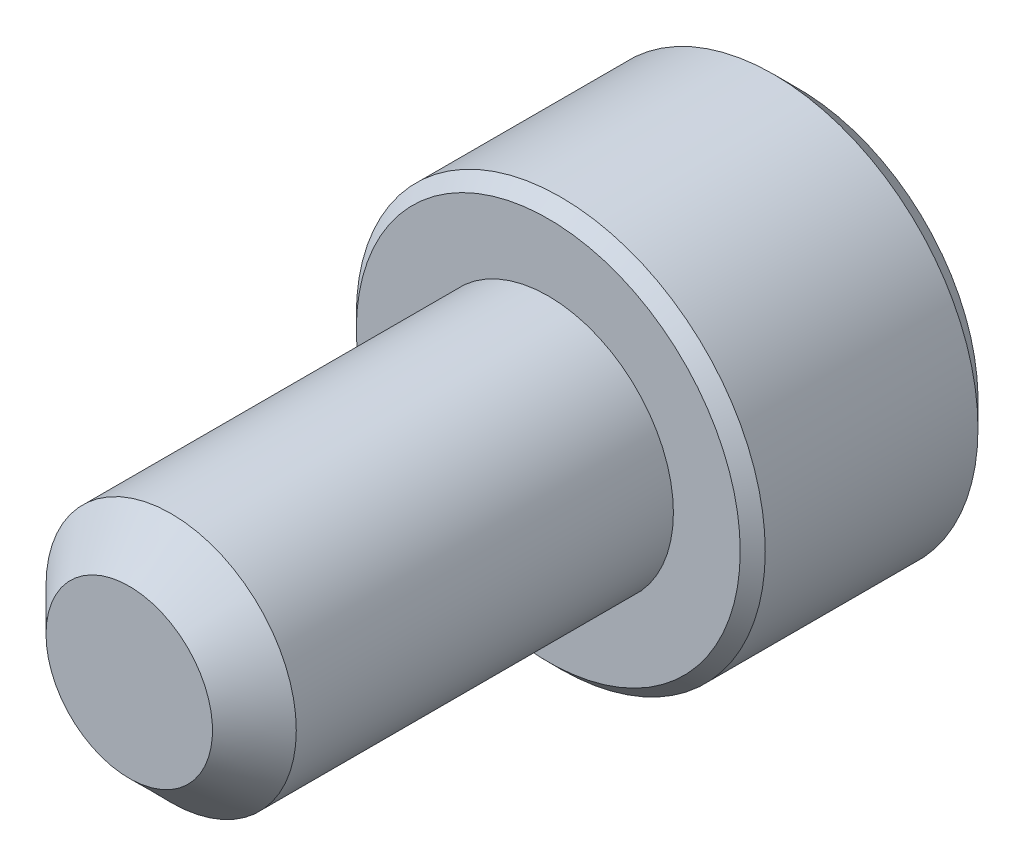
ISO-10303-21;
HEADER;
FILE_DESCRIPTION(('STEP AP214'),'2;1');
FILE_NAME('part.step','',(''),(''),'','','');
FILE_SCHEMA(('AUTOMOTIVE_DESIGN { 1 0 10303 214 1 1 1 1 }'));
ENDSEC;
DATA;
#1=APPLICATION_CONTEXT('core data for automotive mechanical design processes');
#2=APPLICATION_PROTOCOL_DEFINITION('international standard','automotive_design',2000,#1);
#3=PRODUCT_CONTEXT('',#1,'mechanical');
#4=PRODUCT('Part','Part','',(#3));
#5=PRODUCT_RELATED_PRODUCT_CATEGORY('part','',(#4));
#6=PRODUCT_DEFINITION_FORMATION('','',#4);
#7=PRODUCT_DEFINITION_CONTEXT('part definition',#1,'design');
#8=PRODUCT_DEFINITION('design','',#6,#7);
#9=PRODUCT_DEFINITION_SHAPE('','',#8);
#10=(LENGTH_UNIT() NAMED_UNIT(*) SI_UNIT(.MILLI.,.METRE.));
#11=(NAMED_UNIT(*) PLANE_ANGLE_UNIT() SI_UNIT($,.RADIAN.));
#12=(NAMED_UNIT(*) SI_UNIT($,.STERADIAN.) SOLID_ANGLE_UNIT());
#13=UNCERTAINTY_MEASURE_WITH_UNIT(LENGTH_MEASURE(1.E-05),#10,'distance_accuracy_value','');
#14=(GEOMETRIC_REPRESENTATION_CONTEXT(3) GLOBAL_UNCERTAINTY_ASSIGNED_CONTEXT((#13)) GLOBAL_UNIT_ASSIGNED_CONTEXT((#10,
#11,#12)) REPRESENTATION_CONTEXT('',''));
#15=CARTESIAN_POINT('',(0.,0.,0.));
#16=DIRECTION('',(0.,0.,1.));
#17=DIRECTION('',(1.,0.,0.));
#18=AXIS2_PLACEMENT_3D('',#15,#16,#17);
#19=CARTESIAN_POINT('',(0.,-1.3748153285078,-5.8213625));
#20=DIRECTION('',(-0.5,-0.866025403784439,0.));
#21=DIRECTION('',(0.866025403784439,-0.5,0.));
#22=AXIS2_PLACEMENT_3D('',#19,#20,#21);
#23=PLANE('',#22);
#24=CARTESIAN_POINT('',(-1.19062500001474,-0.687407664245389,-7.60729999995952));
#25=CARTESIAN_POINT('',(-1.14970263916378,-0.711034200298566,-7.58369613528999));
#26=CARTESIAN_POINT('',(-1.10809605275945,-0.735055774159164,-7.56147879632089));
#27=CARTESIAN_POINT('',(-1.02325595333944,-0.784038228397384,-7.52079979726755));
#28=CARTESIAN_POINT('',(-0.98001437643467,-0.809003764463537,-7.50236076356995));
#29=CARTESIAN_POINT('',(-0.89281986332562,-0.859345540078905,-7.47077457060107));
#30=CARTESIAN_POINT('',(-0.848889120877259,-0.884708966057167,-7.45754804212946));
#31=CARTESIAN_POINT('',(-0.76006074704934,-0.935994051598392,-7.43717007140658));
#32=CARTESIAN_POINT('',(-0.715165827353507,-0.961914145570028,-7.43000342342216));
#33=CARTESIAN_POINT('',(-0.637785345132547,-1.00658978781032,-7.42353686841741));
#34=CARTESIAN_POINT('',(-0.605399644533085,-1.02528768076932,-7.42257994963504));
#35=CARTESIAN_POINT('',(-0.540685248331174,-1.06265055483693,-7.42419472913948));
#36=CARTESIAN_POINT('',(-0.508356566900302,-1.08131552776359,-7.4267672068878));
#37=CARTESIAN_POINT('',(-0.444011322800891,-1.11846527176546,-7.43529207148953));
#38=CARTESIAN_POINT('',(-0.411995078567319,-1.13694985899215,-7.44124760127793));
#39=CARTESIAN_POINT('',(-0.348497138374104,-1.17361041185569,-7.45621782107217));
#40=CARTESIAN_POINT('',(-0.317015677884089,-1.19178624154409,-7.4652338237534));
#41=CARTESIAN_POINT('',(-0.236423425362924,-1.23831620023178,-7.4919792357716));
#42=CARTESIAN_POINT('',(-0.187819783517283,-1.26637752593496,-7.51171600111601));
#43=CARTESIAN_POINT('',(-0.092514044344822,-1.32140232010149,-7.55617313923926));
#44=CARTESIAN_POINT('',(-0.045806337004702,-1.34836902750754,-7.58087728917109));
#45=CARTESIAN_POINT('',(1.47390955299064E-11,-1.37481532851631,-7.60729999995952));
#46=B_SPLINE_CURVE_WITH_KNOTS('',3,(#24,#25,#26,#27,#28,#29,#30,#31,#32,#33,#34,#35,#36,#37,#38,
#39,#40,#41,#42,#43,#44,#45),.UNSPECIFIED.,.F.,.F.,(4,2,2,2,2,2,2,2,2,2,4),(0.,
0.158570945776655,0.318065397816435,0.475027617250887,0.631594801049637,0.743660160737506,
0.855750273863031,0.967944692049585,1.08018729276811,1.2583629104134,1.43596581388887),.UNSPECIFIED.);
#47=CARTESIAN_POINT('',(-1.19062500000866,-0.687407664257408,-7.60729999996027));
#48=VERTEX_POINT('',#47);
#49=CARTESIAN_POINT('',(-1.29196725261189E-12,-1.37481532851705,-7.60729999996027));
#50=VERTEX_POINT('',#49);
#51=EDGE_CURVE('E18',#48,#50,#46,.T.);
#52=ORIENTED_EDGE('',*,*,#51,.F.);
#53=DIRECTION('',(0.,0.,1.));
#54=VECTOR('',#53,1.);
#55=CARTESIAN_POINT('',(-1.190625,-0.687407664253898,-5.8213625));
#56=LINE('',#55,#54);
#57=CARTESIAN_POINT('',(-1.190625,-0.687407664253899,-5.8213625));
#58=VERTEX_POINT('',#57);
#59=EDGE_CURVE('E99',#48,#58,#56,.T.);
#60=ORIENTED_EDGE('',*,*,#59,.T.);
#61=DIRECTION('',(0.866025403784439,-0.5,0.));
#62=VECTOR('',#61,1.);
#63=CARTESIAN_POINT('',(0.,-1.3748153285078,-5.8213625));
#64=LINE('',#63,#62);
#65=CARTESIAN_POINT('',(0.,-1.3748153285078,-5.8213625));
#66=VERTEX_POINT('',#65);
#67=EDGE_CURVE('E72',#66,#58,#64,.F.);
#68=ORIENTED_EDGE('',*,*,#67,.F.);
#69=DIRECTION('',(0.,0.,1.));
#70=VECTOR('',#69,1.);
#71=CARTESIAN_POINT('',(0.,-1.3748153285078,-5.8213625));
#72=LINE('',#71,#70);
#73=EDGE_CURVE('E71',#66,#50,#72,.F.);
#74=ORIENTED_EDGE('',*,*,#73,.T.);
#75=EDGE_LOOP('',(#52,#60,#68,#74));
#76=FACE_BOUND('',#75,.T.);
#77=ADVANCED_FACE('F14',(#76),#23,.F.);
#78=CARTESIAN_POINT('',(1.190625,-0.687407664253898,-5.8213625));
#79=DIRECTION('',(0.5,-0.866025403784439,0.));
#80=DIRECTION('',(0.866025403784439,0.5,0.));
#81=AXIS2_PLACEMENT_3D('',#78,#79,#80);
#82=PLANE('',#81);
#83=CARTESIAN_POINT('',(-1.47389745819869E-11,-1.37481532851631,-7.60729999995952));
#84=CARTESIAN_POINT('',(0.0409223608362217,-1.35118879246313,-7.58369613528999));
#85=CARTESIAN_POINT('',(0.0825289472405448,-1.32716721860253,-7.56147879632089));
#86=CARTESIAN_POINT('',(0.16736904666056,-1.27818476436431,-7.52079979726755));
#87=CARTESIAN_POINT('',(0.21061062356533,-1.25321922829816,-7.50236076356995));
#88=CARTESIAN_POINT('',(0.297805136674379,-1.20287745268279,-7.47077457060107));
#89=CARTESIAN_POINT('',(0.341735879122741,-1.17751402670453,-7.45754804212946));
#90=CARTESIAN_POINT('',(0.430564252950659,-1.1262289411633,-7.43717007140658));
#91=CARTESIAN_POINT('',(0.475459172646492,-1.10030884719167,-7.43000342342216));
#92=CARTESIAN_POINT('',(0.552839654867452,-1.05563320495137,-7.42353686841741));
#93=CARTESIAN_POINT('',(0.585225355466913,-1.03693531199238,-7.42257994963504));
#94=CARTESIAN_POINT('',(0.649939751668824,-0.999572437924762,-7.42419472913948));
#95=CARTESIAN_POINT('',(0.682268433099697,-0.980907464998102,-7.4267672068878));
#96=CARTESIAN_POINT('',(0.746613677199107,-0.943757720996236,-7.43529207148953));
#97=CARTESIAN_POINT('',(0.77862992143268,-0.925273133769542,-7.44124760127793));
#98=CARTESIAN_POINT('',(0.842127861625894,-0.888612580906002,-7.45621782107217));
#99=CARTESIAN_POINT('',(0.87360932211591,-0.87043675121761,-7.4652338237534));
#100=CARTESIAN_POINT('',(0.954201574637075,-0.823906792529916,-7.4919792357716));
#101=CARTESIAN_POINT('',(1.00280521648272,-0.795845466826739,-7.51171600111601));
#102=CARTESIAN_POINT('',(1.09811095565518,-0.740820672660202,-7.55617313923926));
#103=CARTESIAN_POINT('',(1.1448186629953,-0.713853965254154,-7.58087728917109));
#104=CARTESIAN_POINT('',(1.19062500001474,-0.687407664245389,-7.60729999995952));
#105=B_SPLINE_CURVE_WITH_KNOTS('',3,(#83,#84,#85,#86,#87,#88,#89,#90,#91,#92,#93,#94,#95,#96,
#97,#98,#99,#100,#101,#102,#103,#104),.UNSPECIFIED.,.F.,.F.,(4,2,2,2,2,2,2,2,2,2,4),(0.,
0.158570945776654,0.318065397816434,0.475027617250886,0.631594801049636,0.743660160737505,
0.85575027386303,0.967944692049583,1.08018729276811,1.2583629104134,1.43596581388887),.UNSPECIFIED.);
#106=CARTESIAN_POINT('',(1.19062500000737,-0.687407664259645,-7.60729999996027));
#107=VERTEX_POINT('',#106);
#108=EDGE_CURVE('E79',#50,#107,#105,.T.);
#109=ORIENTED_EDGE('',*,*,#108,.F.);
#110=ORIENTED_EDGE('',*,*,#73,.F.);
#111=DIRECTION('',(-0.866025403784439,-0.5,0.));
#112=VECTOR('',#111,1.);
#113=CARTESIAN_POINT('',(1.190625,-0.687407664253899,-5.8213625));
#114=LINE('',#113,#112);
#115=CARTESIAN_POINT('',(1.190625,-0.687407664253899,-5.8213625));
#116=VERTEX_POINT('',#115);
#117=EDGE_CURVE('E245',#116,#66,#114,.T.);
#118=ORIENTED_EDGE('',*,*,#117,.F.);
#119=DIRECTION('',(0.,0.,1.));
#120=VECTOR('',#119,1.);
#121=CARTESIAN_POINT('',(1.190625,-0.687407664253898,-5.8213625));
#122=LINE('',#121,#120);
#123=EDGE_CURVE('E98',#116,#107,#122,.F.);
#124=ORIENTED_EDGE('',*,*,#123,.T.);
#125=EDGE_LOOP('',(#109,#110,#118,#124));
#126=FACE_BOUND('',#125,.T.);
#127=ADVANCED_FACE('F96',(#126),#82,.F.);
#128=CARTESIAN_POINT('',(-1.190625,-0.687407664253898,-5.8213625));
#129=DIRECTION('',(-1.,0.,0.));
#130=DIRECTION('',(0.,-1.,0.));
#131=AXIS2_PLACEMENT_3D('',#128,#129,#130);
#132=PLANE('',#131);
#133=CARTESIAN_POINT('',(-1.190625,0.687407664270918,-7.60729999995952));
#134=CARTESIAN_POINT('',(-1.190625,0.640463282069563,-7.58384971016085));
#135=CARTESIAN_POINT('',(-1.190625,0.59273899139373,-7.5617686860931));
#136=CARTESIAN_POINT('',(-1.190625,0.495406225249034,-7.52129372298424));
#137=CARTESIAN_POINT('',(-1.190625,0.445787629556659,-7.50292433634604));
#138=CARTESIAN_POINT('',(-1.190625,0.345116375786886,-7.47120435367277));
#139=CARTESIAN_POINT('',(-1.190625,0.294069215530455,-7.45783677245592));
#140=CARTESIAN_POINT('',(-1.190625,0.190855854751405,-7.43725680329601));
#141=CARTESIAN_POINT('',(-1.190625,0.138693633065745,-7.43002538133436));
#142=CARTESIAN_POINT('',(-1.190625,0.0719511129782222,-7.42519466153748));
#143=CARTESIAN_POINT('',(-1.190625,0.0575681066401037,-7.42441368529817));
#144=CARTESIAN_POINT('',(-1.190625,0.0287907386933872,-7.42337109572992));
#145=CARTESIAN_POINT('',(-1.190625,0.0143963875096987,-7.42310920026781));
#146=CARTESIAN_POINT('',(-1.190625,-0.0361321030415007,-7.42311085400087));
#147=CARTESIAN_POINT('',(-1.190625,-0.0722770331313745,-7.42476471374965));
#148=CARTESIAN_POINT('',(-1.190625,-0.144284982569752,-7.43128193069888));
#149=CARTESIAN_POINT('',(-1.190625,-0.180147787625371,-7.4361475264469));
#150=CARTESIAN_POINT('',(-1.190625,-0.287258251635275,-7.45525773762756));
#151=CARTESIAN_POINT('',(-1.190625,-0.357725297303735,-7.47401253561359));
#152=CARTESIAN_POINT('',(-1.190625,-0.471552892407799,-7.51238002149889));
#153=CARTESIAN_POINT('',(-1.190625,-0.515840765876029,-7.52944074656349));
#154=CARTESIAN_POINT('',(-1.190625,-0.602739573095866,-7.56641684237244));
#155=CARTESIAN_POINT('',(-1.190625,-0.645362139934235,-7.58630467577845));
#156=CARTESIAN_POINT('',(-1.190625,-0.687407664270918,-7.60729999995952));
#157=B_SPLINE_CURVE_WITH_KNOTS('',3,(#133,#134,#135,#136,#137,#138,#139,#140,#141,#142,#143,
#144,#145,#146,#147,#148,#149,#150,#151,#152,#153,#154,#155,#156),.UNSPECIFIED.,.F.,.F.,(4,2,2,
2,2,2,2,2,2,2,2,4),(0.,0.157535403105739,0.31608104146544,0.474083294588325,0.631593623098254,
0.674799715063236,0.717982317007914,0.826362160355007,0.934817623234313,1.15262451048446,
1.29491478053908,1.43590359049897),.UNSPECIFIED.);
#158=CARTESIAN_POINT('',(-1.19062500000737,0.687407664259645,-7.60729999996027));
#159=VERTEX_POINT('',#158);
#160=EDGE_CURVE('E56',#159,#48,#157,.T.);
#161=ORIENTED_EDGE('',*,*,#160,.F.);
#162=DIRECTION('',(0.,0.,1.));
#163=VECTOR('',#162,1.);
#164=CARTESIAN_POINT('',(-1.190625,0.687407664253898,-5.8213625));
#165=LINE('',#164,#163);
#166=CARTESIAN_POINT('',(-1.190625,0.687407664253899,-5.8213625));
#167=VERTEX_POINT('',#166);
#168=EDGE_CURVE('E232',#159,#167,#165,.T.);
#169=ORIENTED_EDGE('',*,*,#168,.T.);
#170=DIRECTION('',(0.,1.,0.));
#171=VECTOR('',#170,1.);
#172=CARTESIAN_POINT('',(-1.190625,2.06222299276169,-5.8213625));
#173=LINE('',#172,#171);
#174=EDGE_CURVE('E243',#58,#167,#173,.T.);
#175=ORIENTED_EDGE('',*,*,#174,.F.);
#176=ORIENTED_EDGE('',*,*,#59,.F.);
#177=EDGE_LOOP('',(#161,#169,#175,#176));
#178=FACE_BOUND('',#177,.T.);
#179=ADVANCED_FACE('F115',(#178),#132,.F.);
#180=CARTESIAN_POINT('',(1.190625,2.06222299276169,-5.8213625));
#181=DIRECTION('',(0.,0.,-1.));
#182=DIRECTION('',(-1.,0.,0.));
#183=AXIS2_PLACEMENT_3D('',#180,#181,#182);
#184=PLANE('',#183);
#185=ORIENTED_EDGE('',*,*,#67,.T.);
#186=ORIENTED_EDGE('',*,*,#174,.T.);
#187=DIRECTION('',(-0.866025403784439,-0.5,0.));
#188=VECTOR('',#187,1.);
#189=CARTESIAN_POINT('',(-1.190625,0.687407664253898,-5.8213625));
#190=LINE('',#189,#188);
#191=CARTESIAN_POINT('',(0.,1.3748153285078,-5.8213625));
#192=VERTEX_POINT('',#191);
#193=EDGE_CURVE('E136',#167,#192,#190,.F.);
#194=ORIENTED_EDGE('',*,*,#193,.T.);
#195=DIRECTION('',(-0.866025403784439,0.5,0.));
#196=VECTOR('',#195,1.);
#197=CARTESIAN_POINT('',(0.,1.3748153285078,-5.8213625));
#198=LINE('',#197,#196);
#199=CARTESIAN_POINT('',(1.190625,0.687407664253898,-5.8213625));
#200=VERTEX_POINT('',#199);
#201=EDGE_CURVE('E231',#192,#200,#198,.F.);
#202=ORIENTED_EDGE('',*,*,#201,.T.);
#203=DIRECTION('',(0.,1.,0.));
#204=VECTOR('',#203,1.);
#205=CARTESIAN_POINT('',(1.190625,0.687407664253898,-5.8213625));
#206=LINE('',#205,#204);
#207=EDGE_CURVE('E240',#200,#116,#206,.F.);
#208=ORIENTED_EDGE('',*,*,#207,.T.);
#209=ORIENTED_EDGE('',*,*,#117,.T.);
#210=EDGE_LOOP('',(#185,#186,#194,#202,#208,#209));
#211=FACE_BOUND('',#210,.T.);
#212=ADVANCED_FACE('F119',(#211),#184,.T.);
#213=CARTESIAN_POINT('',(1.190625,0.687407664253898,-5.8213625));
#214=DIRECTION('',(1.,0.,0.));
#215=DIRECTION('',(0.,1.,0.));
#216=AXIS2_PLACEMENT_3D('',#213,#214,#215);
#217=PLANE('',#216);
#218=CARTESIAN_POINT('',(1.190625,-0.687407664270917,-7.60729999995952));
#219=CARTESIAN_POINT('',(1.190625,-0.640154592164564,-7.58369613528999));
#220=CARTESIAN_POINT('',(1.190625,-0.59211144444337,-7.56147879632089));
#221=CARTESIAN_POINT('',(1.190625,-0.494146535966932,-7.52079979726756));
#222=CARTESIAN_POINT('',(1.190625,-0.444215463834627,-7.50236076356995));
#223=CARTESIAN_POINT('',(1.190625,-0.343531912603891,-7.47077457060107));
#224=CARTESIAN_POINT('',(1.190625,-0.292805060647367,-7.45754804212946));
#225=CARTESIAN_POINT('',(1.190625,-0.190234889564914,-7.43717007140658));
#226=CARTESIAN_POINT('',(1.190625,-0.138394701621641,-7.43000342342216));
#227=CARTESIAN_POINT('',(1.190625,-0.0490434171410509,-7.42353686841741));
#228=CARTESIAN_POINT('',(1.190625,-0.0116476312230634,-7.42257994963504));
#229=CARTESIAN_POINT('',(1.190625,0.0630781169121723,-7.42419472913948));
#230=CARTESIAN_POINT('',(1.190625,0.100408062765493,-7.4267672068878));
#231=CARTESIAN_POINT('',(1.190625,0.174707550769226,-7.43529207148953));
#232=CARTESIAN_POINT('',(1.190625,0.211676725222613,-7.44124760127793));
#233=CARTESIAN_POINT('',(1.190625,0.284997830949691,-7.45621782107217));
#234=CARTESIAN_POINT('',(1.190625,0.321349490326476,-7.4652338237534));
#235=CARTESIAN_POINT('',(1.190625,0.41440940770163,-7.49197923577154));
#236=CARTESIAN_POINT('',(1.190625,0.470532059107761,-7.51171600111585));
#237=CARTESIAN_POINT('',(1.190625,0.580581647440405,-7.55617313923888));
#238=CARTESIAN_POINT('',(1.190625,0.634515062252296,-7.58087728917058));
#239=CARTESIAN_POINT('',(1.190625,0.687407664269629,-7.60729999995888));
#240=B_SPLINE_CURVE_WITH_KNOTS('',3,(#218,#219,#220,#221,#222,#223,#224,#225,#226,#227,#228,
#229,#230,#231,#232,#233,#234,#235,#236,#237,#238,#239),.UNSPECIFIED.,.F.,.F.,(4,2,2,2,2,2,2,2,
2,2,4),(0.,0.158570945776651,0.318065397816427,0.475027617250882,0.631594801049636,
0.743660160737506,0.855750273863032,0.967944692049585,1.08018729276811,1.25836291041268,
1.43596581388743),.UNSPECIFIED.);
#241=CARTESIAN_POINT('',(1.19062500000681,0.687407664257831,-7.60729999995888));
#242=VERTEX_POINT('',#241);
#243=EDGE_CURVE('E36',#107,#242,#240,.T.);
#244=ORIENTED_EDGE('',*,*,#243,.F.);
#245=ORIENTED_EDGE('',*,*,#123,.F.);
#246=ORIENTED_EDGE('',*,*,#207,.F.);
#247=DIRECTION('',(0.,0.,1.));
#248=VECTOR('',#247,1.);
#249=CARTESIAN_POINT('',(1.190625,0.687407664253898,-5.8213625));
#250=LINE('',#249,#248);
#251=EDGE_CURVE('E229',#200,#242,#250,.F.);
#252=ORIENTED_EDGE('',*,*,#251,.T.);
#253=EDGE_LOOP('',(#244,#245,#246,#252));
#254=FACE_BOUND('',#253,.T.);
#255=ADVANCED_FACE('F123',(#254),#217,.F.);
#256=CARTESIAN_POINT('',(-1.190625,0.687407664253898,-5.8213625));
#257=DIRECTION('',(-0.5,0.866025403784439,0.));
#258=DIRECTION('',(-0.866025403784439,-0.5,0.));
#259=AXIS2_PLACEMENT_3D('',#256,#257,#258);
#260=PLANE('',#259);
#261=CARTESIAN_POINT('',(1.36231872988507E-11,1.37481532851566,-7.60729999995888));
#262=CARTESIAN_POINT('',(-0.0409223608372712,1.35118879246252,-7.58369613528941));
#263=CARTESIAN_POINT('',(-0.0825289472415261,1.32716721860196,-7.56147879632038));
#264=CARTESIAN_POINT('',(-0.167369046661398,1.27818476436383,-7.52079979726718));
#265=CARTESIAN_POINT('',(-0.210610623566094,1.25321922829772,-7.50236076356964));
#266=CARTESIAN_POINT('',(-0.29780513667499,1.20287745268244,-7.47077457060088));
#267=CARTESIAN_POINT('',(-0.341735879123273,1.17751402670422,-7.45754804212932));
#268=CARTESIAN_POINT('',(-0.430564252951029,1.12622894116309,-7.43717007140651));
#269=CARTESIAN_POINT('',(-0.475459172646779,1.1003088471915,-7.43000342342213));
#270=CARTESIAN_POINT('',(-0.55283965486765,1.05563320495126,-7.4235368684174));
#271=CARTESIAN_POINT('',(-0.585225355467108,1.03693531199227,-7.42257994963504));
#272=CARTESIAN_POINT('',(-0.649939751669011,0.999572437924654,-7.42419472913949));
#273=CARTESIAN_POINT('',(-0.682268433099879,0.980907464997997,-7.42676720688782));
#274=CARTESIAN_POINT('',(-0.746613677199281,0.943757720996135,-7.43529207148956));
#275=CARTESIAN_POINT('',(-0.778629921432849,0.925273133769444,-7.44124760127796));
#276=CARTESIAN_POINT('',(-0.842127861626056,0.888612580905909,-7.45621782107221));
#277=CARTESIAN_POINT('',(-0.873609322116067,0.870436751217519,-7.46523382375345));
#278=CARTESIAN_POINT('',(-0.954201574637201,0.823906792529843,-7.49197923577165));
#279=CARTESIAN_POINT('',(-1.00280521648282,0.795845466826681,-7.51171600111605));
#280=CARTESIAN_POINT('',(-1.09811095565523,0.740820672660174,-7.55617313923929));
#281=CARTESIAN_POINT('',(-1.14481866299532,0.71385396525414,-7.5808772891711));
#282=CARTESIAN_POINT('',(-1.19062500001474,0.687407664245389,-7.60729999995952));
#283=B_SPLINE_CURVE_WITH_KNOTS('',3,(#261,#262,#263,#264,#265,#266,#267,#268,#269,#270,#271,
#272,#273,#274,#275,#276,#277,#278,#279,#280,#281,#282),.UNSPECIFIED.,.F.,.F.,(4,2,2,2,2,2,2,2,
2,2,4),(0.,0.158570945776352,0.318065397815825,0.475027617249976,0.63159480104843,
0.743660160736285,0.855750273861797,0.967944692048339,1.08018729276685,1.25836291041205,
1.43596581388743),.UNSPECIFIED.);
#284=CARTESIAN_POINT('',(-1.84989494419728E-12,1.37481532851673,-7.60729999995995));
#285=VERTEX_POINT('',#284);
#286=EDGE_CURVE('E137',#285,#159,#283,.T.);
#287=ORIENTED_EDGE('',*,*,#286,.F.);
#288=DIRECTION('',(0.,0.,1.));
#289=VECTOR('',#288,1.);
#290=CARTESIAN_POINT('',(0.,1.3748153285078,-5.8213625));
#291=LINE('',#290,#289);
#292=EDGE_CURVE('E160',#285,#192,#291,.T.);
#293=ORIENTED_EDGE('',*,*,#292,.T.);
#294=ORIENTED_EDGE('',*,*,#193,.F.);
#295=ORIENTED_EDGE('',*,*,#168,.F.);
#296=EDGE_LOOP('',(#287,#293,#294,#295));
#297=FACE_BOUND('',#296,.T.);
#298=ADVANCED_FACE('F128',(#297),#260,.F.);
#299=CARTESIAN_POINT('',(0.,1.3748153285078,-5.8213625));
#300=DIRECTION('',(0.5,0.866025403784439,0.));
#301=DIRECTION('',(-0.866025403784439,0.5,0.));
#302=AXIS2_PLACEMENT_3D('',#299,#300,#301);
#303=PLANE('',#302);
#304=CARTESIAN_POINT('',(-1.57937141503361E-11,1.37481532850883,-7.60729999996195));
#305=CARTESIAN_POINT('',(0.0409223608363385,1.35118879246015,-7.58369613529061));
#306=CARTESIAN_POINT('',(0.0825289472409715,1.3271672186015,-7.56147879632087));
#307=CARTESIAN_POINT('',(0.167369046660793,1.27818476436496,-7.52079979726726));
#308=CARTESIAN_POINT('',(0.210610623565053,1.25321922829853,-7.50236076357002));
#309=CARTESIAN_POINT('',(0.297805136673245,1.20287745268324,-7.47077457060151));
#310=CARTESIAN_POINT('',(0.341735879121255,1.17751402670533,-7.45754804212991));
#311=CARTESIAN_POINT('',(0.430564252948422,1.12622894116465,-7.43717007140698));
#312=CARTESIAN_POINT('',(0.475459172643857,1.1003088471932,-7.43000342342253));
#313=CARTESIAN_POINT('',(0.552839654864332,1.05563320495317,-7.42353686841757));
#314=CARTESIAN_POINT('',(0.585225355463703,1.03693531199423,-7.42257994963508));
#315=CARTESIAN_POINT('',(0.649939751665438,0.999572437926719,-7.42419472913927));
#316=CARTESIAN_POINT('',(0.682268433096227,0.980907465000106,-7.42676720688747));
#317=CARTESIAN_POINT('',(0.746613677195491,0.943757720998323,-7.43529207148893));
#318=CARTESIAN_POINT('',(0.778629921429001,0.925273133771665,-7.44124760127719));
#319=CARTESIAN_POINT('',(0.842127861622102,0.888612580908192,-7.45621782107115));
#320=CARTESIAN_POINT('',(0.873609322112064,0.87043675121983,-7.46523382375225));
#321=CARTESIAN_POINT('',(0.954201574633594,0.823906792531926,-7.49197923577026));
#322=CARTESIAN_POINT('',(1.00280521647964,0.795845466828515,-7.51171600111469));
#323=CARTESIAN_POINT('',(1.09811095565287,0.740820672661537,-7.55617313923807));
#324=CARTESIAN_POINT('',(1.14481866299335,0.713853965255281,-7.58087728917002));
#325=CARTESIAN_POINT('',(1.19062500001313,0.687407664246318,-7.60729999995859));
#326=B_SPLINE_CURVE_WITH_KNOTS('',3,(#304,#305,#306,#307,#308,#309,#310,#311,#312,#313,#314,
#315,#316,#317,#318,#319,#320,#321,#322,#323,#324,#325),.UNSPECIFIED.,.F.,.F.,(4,2,2,2,2,2,2,2,
2,2,4),(0.,0.158570945775536,0.31806539781404,0.47502761724713,0.631594801044589,
0.743660160732147,0.855750273857356,0.967944692043632,1.08018729276188,1.2583629104085,
1.43596581388524),.UNSPECIFIED.);
#327=EDGE_CURVE('E153',#285,#242,#326,.T.);
#328=ORIENTED_EDGE('',*,*,#327,.T.);
#329=ORIENTED_EDGE('',*,*,#251,.F.);
#330=ORIENTED_EDGE('',*,*,#201,.F.);
#331=ORIENTED_EDGE('',*,*,#292,.F.);
#332=EDGE_LOOP('',(#328,#329,#330,#331));
#333=FACE_BOUND('',#332,.T.);
#334=ADVANCED_FACE('F162',(#333),#303,.F.);
#335=CARTESIAN_POINT('',(0.,0.,-7.60729999990417));
#336=DIRECTION('',(0.,0.,-1.));
#337=DIRECTION('',(-1.,0.,0.));
#338=AXIS2_PLACEMENT_3D('',#335,#336,#337);
#339=CONICAL_SURFACE('',#338,1.37481532846095,0.785398163397448);
#340=ORIENTED_EDGE('',*,*,#286,.T.);
#341=CARTESIAN_POINT('',(0.,0.,-7.60729999996101));
#342=DIRECTION('',(0.,0.,-1.));
#343=DIRECTION('',(-1.,0.,0.));
#344=AXIS2_PLACEMENT_3D('',#341,#342,#343);
#345=CIRCLE('',#344,1.3748153285178);
#346=EDGE_CURVE('E159',#285,#159,#345,.F.);
#347=ORIENTED_EDGE('',*,*,#346,.F.);
#348=EDGE_LOOP('',(#340,#347));
#349=FACE_BOUND('',#348,.T.);
#350=ADVANCED_FACE('F165',(#349),#339,.F.);
#351=CARTESIAN_POINT('',(0.,0.,-7.60729999990417));
#352=DIRECTION('',(0.,0.,-1.));
#353=DIRECTION('',(-1.,0.,0.));
#354=AXIS2_PLACEMENT_3D('',#351,#352,#353);
#355=CONICAL_SURFACE('',#354,1.37481532846095,0.785398163397448);
#356=ORIENTED_EDGE('',*,*,#160,.T.);
#357=CARTESIAN_POINT('',(0.,0.,-7.60729999996101));
#358=DIRECTION('',(0.,0.,-1.));
#359=DIRECTION('',(-1.,0.,0.));
#360=AXIS2_PLACEMENT_3D('',#357,#358,#359);
#361=CIRCLE('',#360,1.3748153285178);
#362=EDGE_CURVE('E89',#159,#48,#361,.F.);
#363=ORIENTED_EDGE('',*,*,#362,.F.);
#364=EDGE_LOOP('',(#356,#363));
#365=FACE_BOUND('',#364,.T.);
#366=ADVANCED_FACE('F169',(#365),#355,.F.);
#367=CARTESIAN_POINT('',(0.,0.,-7.60729999990417));
#368=DIRECTION('',(0.,0.,-1.));
#369=DIRECTION('',(-1.,0.,0.));
#370=AXIS2_PLACEMENT_3D('',#367,#368,#369);
#371=CONICAL_SURFACE('',#370,1.37481532846095,0.785398163397448);
#372=ORIENTED_EDGE('',*,*,#51,.T.);
#373=CARTESIAN_POINT('',(0.,0.,-7.60729999996101));
#374=DIRECTION('',(0.,0.,-1.));
#375=DIRECTION('',(-1.,0.,0.));
#376=AXIS2_PLACEMENT_3D('',#373,#374,#375);
#377=CIRCLE('',#376,1.3748153285178);
#378=EDGE_CURVE('E67',#48,#50,#377,.F.);
#379=ORIENTED_EDGE('',*,*,#378,.F.);
#380=EDGE_LOOP('',(#372,#379));
#381=FACE_BOUND('',#380,.T.);
#382=ADVANCED_FACE('F65',(#381),#371,.F.);
#383=CARTESIAN_POINT('',(0.,0.,-7.60729999990417));
#384=DIRECTION('',(0.,0.,-1.));
#385=DIRECTION('',(-1.,0.,0.));
#386=AXIS2_PLACEMENT_3D('',#383,#384,#385);
#387=CONICAL_SURFACE('',#386,1.37481532846095,0.785398163397448);
#388=ORIENTED_EDGE('',*,*,#108,.T.);
#389=CARTESIAN_POINT('',(0.,0.,-7.60729999996101));
#390=DIRECTION('',(0.,0.,-1.));
#391=DIRECTION('',(-1.,0.,0.));
#392=AXIS2_PLACEMENT_3D('',#389,#390,#391);
#393=CIRCLE('',#392,1.3748153285178);
#394=EDGE_CURVE('E87',#50,#107,#393,.F.);
#395=ORIENTED_EDGE('',*,*,#394,.F.);
#396=EDGE_LOOP('',(#388,#395));
#397=FACE_BOUND('',#396,.T.);
#398=ADVANCED_FACE('F92',(#397),#387,.F.);
#399=CARTESIAN_POINT('',(0.,0.,-7.60729999990417));
#400=DIRECTION('',(0.,0.,-1.));
#401=DIRECTION('',(-1.,0.,0.));
#402=AXIS2_PLACEMENT_3D('',#399,#400,#401);
#403=CONICAL_SURFACE('',#402,1.37481532846095,0.785398163397448);
#404=ORIENTED_EDGE('',*,*,#243,.T.);
#405=CARTESIAN_POINT('',(0.,0.,-7.60729999996101));
#406=DIRECTION('',(0.,0.,-1.));
#407=DIRECTION('',(-1.,0.,0.));
#408=AXIS2_PLACEMENT_3D('',#405,#406,#407);
#409=CIRCLE('',#408,1.3748153285178);
#410=EDGE_CURVE('E94',#107,#242,#409,.F.);
#411=ORIENTED_EDGE('',*,*,#410,.F.);
#412=EDGE_LOOP('',(#404,#411));
#413=FACE_BOUND('',#412,.T.);
#414=ADVANCED_FACE('F143',(#413),#403,.F.);
#415=CARTESIAN_POINT('',(0.,0.,-7.60729999990417));
#416=DIRECTION('',(0.,0.,-1.));
#417=DIRECTION('',(-1.,0.,0.));
#418=AXIS2_PLACEMENT_3D('',#415,#416,#417);
#419=CONICAL_SURFACE('',#418,1.37481532846095,0.785398163397448);
#420=ORIENTED_EDGE('',*,*,#327,.F.);
#421=CARTESIAN_POINT('',(0.,0.,-7.60729999996101));
#422=DIRECTION('',(0.,0.,-1.));
#423=DIRECTION('',(-1.,0.,0.));
#424=AXIS2_PLACEMENT_3D('',#421,#422,#423);
#425=CIRCLE('',#424,1.3748153285178);
#426=EDGE_CURVE('E224',#242,#285,#425,.F.);
#427=ORIENTED_EDGE('',*,*,#426,.F.);
#428=EDGE_LOOP('',(#420,#427));
#429=FACE_BOUND('',#428,.T.);
#430=ADVANCED_FACE('F147',(#429),#419,.F.);
#431=CARTESIAN_POINT('',(0.,0.,-7.6073));
#432=DIRECTION('',(0.,0.,-1.));
#433=DIRECTION('',(-1.,0.,0.));
#434=AXIS2_PLACEMENT_3D('',#431,#432,#433);
#435=PLANE('',#434);
#436=ORIENTED_EDGE('',*,*,#410,.T.);
#437=ORIENTED_EDGE('',*,*,#426,.T.);
#438=ORIENTED_EDGE('',*,*,#346,.T.);
#439=ORIENTED_EDGE('',*,*,#362,.T.);
#440=ORIENTED_EDGE('',*,*,#378,.T.);
#441=ORIENTED_EDGE('',*,*,#394,.T.);
#442=EDGE_LOOP('',(#436,#437,#438,#439,#440,#441));
#443=FACE_BOUND('',#442,.T.);
#444=CARTESIAN_POINT('',(0.,0.,-7.60729999996101));
#445=DIRECTION('',(0.,0.,1.));
#446=DIRECTION('',(0.,-1.,0.));
#447=AXIS2_PLACEMENT_3D('',#444,#445,#446);
#448=CIRCLE('',#447,2.03962000000502);
#449=CARTESIAN_POINT('',(0.,-2.03962000000502,-7.60729999996101));
#450=VERTEX_POINT('',#449);
#451=EDGE_CURVE('E215',#450,#450,#448,.T.);
#452=ORIENTED_EDGE('',*,*,#451,.F.);
#453=EDGE_LOOP('',(#452));
#454=FACE_BOUND('',#453,.T.);
#455=ADVANCED_FACE('F85',(#443,#454),#435,.T.);
#456=CARTESIAN_POINT('',(0.,0.,-7.32282000001305));
#457=DIRECTION('',(0.,0.,1.));
#458=DIRECTION('',(0.,-1.,0.));
#459=AXIS2_PLACEMENT_3D('',#456,#457,#458);
#460=CONICAL_SURFACE('',#459,2.32410000000982,0.785398163497356);
#461=ORIENTED_EDGE('',*,*,#451,.T.);
#462=EDGE_LOOP('',(#461));
#463=FACE_BOUND('',#462,.T.);
#464=CARTESIAN_POINT('',(0.,0.,-7.32282));
#465=DIRECTION('',(0.,0.,1.));
#466=DIRECTION('',(1.,0.,0.));
#467=AXIS2_PLACEMENT_3D('',#464,#465,#466);
#468=CIRCLE('',#467,2.3241);
#469=CARTESIAN_POINT('',(2.3241,0.,-7.32282));
#470=VERTEX_POINT('',#469);
#471=EDGE_CURVE('E218',#470,#470,#468,.T.);
#472=ORIENTED_EDGE('',*,*,#471,.F.);
#473=EDGE_LOOP('',(#472));
#474=FACE_BOUND('',#473,.T.);
#475=ADVANCED_FACE('F205',(#463,#474),#460,.T.);
#476=CARTESIAN_POINT('',(0.,0.,-7.6073));
#477=DIRECTION('',(0.,0.,1.));
#478=DIRECTION('',(1.,0.,0.));
#479=AXIS2_PLACEMENT_3D('',#476,#477,#478);
#480=CYLINDRICAL_SURFACE('',#479,2.3241);
#481=ORIENTED_EDGE('',*,*,#471,.T.);
#482=EDGE_LOOP('',(#481));
#483=FACE_BOUND('',#482,.T.);
#484=CARTESIAN_POINT('',(0.,0.,-4.90473999991536));
#485=DIRECTION('',(0.,0.,-1.));
#486=DIRECTION('',(-1.,0.,0.));
#487=AXIS2_PLACEMENT_3D('',#484,#485,#486);
#488=CIRCLE('',#487,2.32410000000982);
#489=CARTESIAN_POINT('',(-2.32410000000982,0.,-4.90473999991536));
#490=VERTEX_POINT('',#489);
#491=EDGE_CURVE('E219',#490,#490,#488,.F.);
#492=ORIENTED_EDGE('',*,*,#491,.F.);
#493=EDGE_LOOP('',(#492));
#494=FACE_BOUND('',#493,.T.);
#495=ADVANCED_FACE('F202',(#483,#494),#480,.T.);
#496=CARTESIAN_POINT('',(0.,0.,-4.90474000002905));
#497=DIRECTION('',(0.,0.,-1.));
#498=DIRECTION('',(-1.,0.,0.));
#499=AXIS2_PLACEMENT_3D('',#496,#497,#498);
#500=CONICAL_SURFACE('',#499,2.32410000006666,0.785398163197633);
#501=CARTESIAN_POINT('',(0.,0.,-4.7624999999698));
#502=DIRECTION('',(0.,0.,-1.));
#503=DIRECTION('',(-1.,0.,0.));
#504=AXIS2_PLACEMENT_3D('',#501,#502,#503);
#505=CIRCLE('',#504,2.18186000006426);
#506=CARTESIAN_POINT('',(-2.18186000006426,0.,-4.7624999999698));
#507=VERTEX_POINT('',#506);
#508=EDGE_CURVE('E222',#507,#507,#505,.T.);
#509=ORIENTED_EDGE('',*,*,#508,.T.);
#510=EDGE_LOOP('',(#509));
#511=FACE_BOUND('',#510,.T.);
#512=ORIENTED_EDGE('',*,*,#491,.T.);
#513=EDGE_LOOP('',(#512));
#514=FACE_BOUND('',#513,.T.);
#515=ADVANCED_FACE('F198',(#511,#514),#500,.T.);
#516=CARTESIAN_POINT('',(0.,0.,0.));
#517=DIRECTION('',(0.,0.,1.));
#518=DIRECTION('',(1.,0.,0.));
#519=AXIS2_PLACEMENT_3D('',#516,#517,#518);
#520=PLANE('',#519);
#521=CARTESIAN_POINT('',(0.,0.,0.));
#522=DIRECTION('',(0.,0.,-1.));
#523=DIRECTION('',(-1.,0.,0.));
#524=AXIS2_PLACEMENT_3D('',#521,#522,#523);
#525=CIRCLE('',#524,0.946150000004309);
#526=CARTESIAN_POINT('',(-0.946150000004309,0.,0.));
#527=VERTEX_POINT('',#526);
#528=EDGE_CURVE('E252',#527,#527,#525,.T.);
#529=ORIENTED_EDGE('',*,*,#528,.F.);
#530=EDGE_LOOP('',(#529));
#531=FACE_BOUND('',#530,.T.);
#532=ADVANCED_FACE('F194',(#531),#520,.T.);
#533=CARTESIAN_POINT('',(0.,0.,-4.7625));
#534=DIRECTION('',(0.,0.,-1.));
#535=DIRECTION('',(-1.,0.,0.));
#536=AXIS2_PLACEMENT_3D('',#533,#534,#535);
#537=PLANE('',#536);
#538=CARTESIAN_POINT('',(0.,0.,-4.7625));
#539=DIRECTION('',(0.,0.,1.));
#540=DIRECTION('',(1.,0.,0.));
#541=AXIS2_PLACEMENT_3D('',#538,#539,#540);
#542=CIRCLE('',#541,1.4224);
#543=CARTESIAN_POINT('',(1.4224,0.,-4.7625));
#544=VERTEX_POINT('',#543);
#545=EDGE_CURVE('E28',#544,#544,#542,.T.);
#546=ORIENTED_EDGE('',*,*,#545,.F.);
#547=EDGE_LOOP('',(#546));
#548=FACE_BOUND('',#547,.T.);
#549=ORIENTED_EDGE('',*,*,#508,.F.);
#550=EDGE_LOOP('',(#549));
#551=FACE_BOUND('',#550,.T.);
#552=ADVANCED_FACE('F187',(#548,#551),#537,.F.);
#553=CARTESIAN_POINT('',(0.,0.,-0.476250000019718));
#554=DIRECTION('',(0.,0.,-1.));
#555=DIRECTION('',(-1.,0.,0.));
#556=AXIS2_PLACEMENT_3D('',#553,#554,#555);
#557=CONICAL_SURFACE('',#556,1.42239999996718,0.78539816333777);
#558=CARTESIAN_POINT('',(0.,0.,-0.47625));
#559=DIRECTION('',(0.,0.,1.));
#560=DIRECTION('',(1.,0.,0.));
#561=AXIS2_PLACEMENT_3D('',#558,#559,#560);
#562=CIRCLE('',#561,1.4224);
#563=CARTESIAN_POINT('',(1.4224,0.,-0.47625));
#564=VERTEX_POINT('',#563);
#565=EDGE_CURVE('E9',#564,#564,#562,.F.);
#566=ORIENTED_EDGE('',*,*,#565,.F.);
#567=EDGE_LOOP('',(#566));
#568=FACE_BOUND('',#567,.T.);
#569=ORIENTED_EDGE('',*,*,#528,.T.);
#570=EDGE_LOOP('',(#569));
#571=FACE_BOUND('',#570,.T.);
#572=ADVANCED_FACE('F181',(#568,#571),#557,.T.);
#573=CARTESIAN_POINT('',(0.,0.,-4.7625));
#574=DIRECTION('',(0.,0.,1.));
#575=DIRECTION('',(1.,0.,0.));
#576=AXIS2_PLACEMENT_3D('',#573,#574,#575);
#577=CYLINDRICAL_SURFACE('',#576,1.4224);
#578=ORIENTED_EDGE('',*,*,#565,.T.);
#579=EDGE_LOOP('',(#578));
#580=FACE_BOUND('',#579,.T.);
#581=ORIENTED_EDGE('',*,*,#545,.T.);
#582=EDGE_LOOP('',(#581));
#583=FACE_BOUND('',#582,.T.);
#584=ADVANCED_FACE('F179',(#580,#583),#577,.T.);
#585=CLOSED_SHELL('',(#77,#127,#179,#212,#255,#298,#334,#350,#366,#382,#398,#414,#430,#455,#475,
#495,#515,#532,#552,#572,#584));
#586=MANIFOLD_SOLID_BREP('B1',#585);
#587=ADVANCED_BREP_SHAPE_REPRESENTATION('',(#18,#586),#14);
#588=SHAPE_DEFINITION_REPRESENTATION(#9,#587);
ENDSEC;
END-ISO-10303-21;
